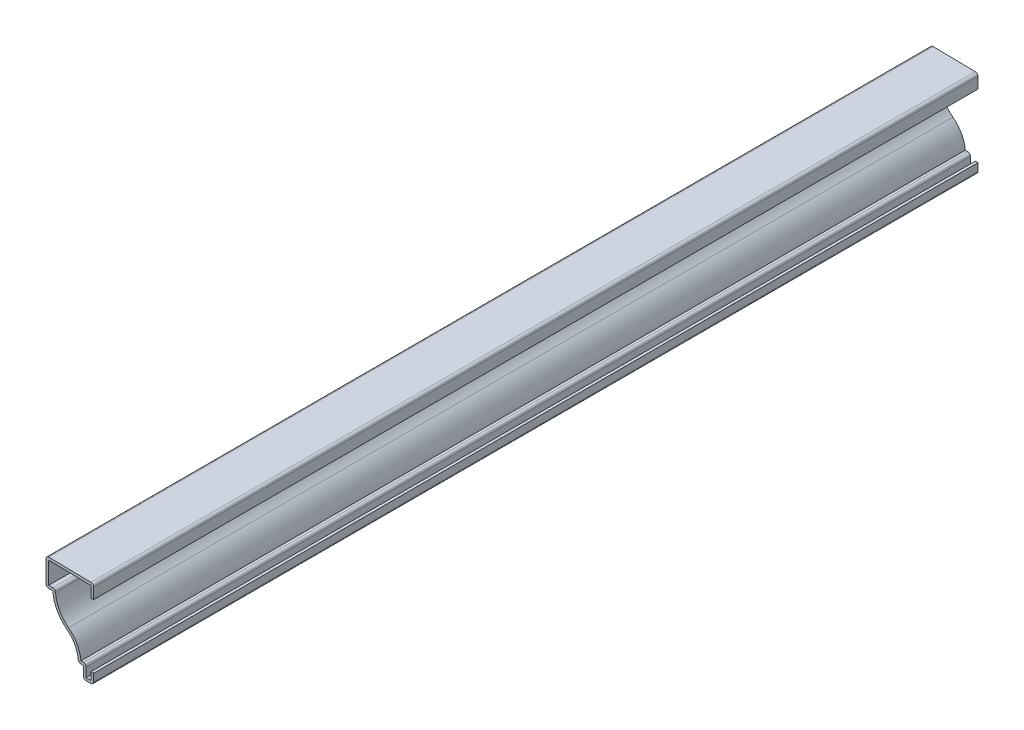
ISO-10303-21;
HEADER;
FILE_DESCRIPTION(('STEP AP214'),'2;1');
FILE_NAME('part.step','',(''),(''),'','','');
FILE_SCHEMA(('AUTOMOTIVE_DESIGN { 1 0 10303 214 1 1 1 1 }'));
ENDSEC;
DATA;
#1=APPLICATION_CONTEXT('core data for automotive mechanical design processes');
#2=APPLICATION_PROTOCOL_DEFINITION('international standard','automotive_design',2000,#1);
#3=PRODUCT_CONTEXT('',#1,'mechanical');
#4=PRODUCT('Part','Part','',(#3));
#5=PRODUCT_RELATED_PRODUCT_CATEGORY('part','',(#4));
#6=PRODUCT_DEFINITION_FORMATION('','',#4);
#7=PRODUCT_DEFINITION_CONTEXT('part definition',#1,'design');
#8=PRODUCT_DEFINITION('design','',#6,#7);
#9=PRODUCT_DEFINITION_SHAPE('','',#8);
#10=(LENGTH_UNIT() NAMED_UNIT(*) SI_UNIT(.MILLI.,.METRE.));
#11=(NAMED_UNIT(*) PLANE_ANGLE_UNIT() SI_UNIT($,.RADIAN.));
#12=(NAMED_UNIT(*) SI_UNIT($,.STERADIAN.) SOLID_ANGLE_UNIT());
#13=UNCERTAINTY_MEASURE_WITH_UNIT(LENGTH_MEASURE(1.E-05),#10,'distance_accuracy_value','');
#14=(GEOMETRIC_REPRESENTATION_CONTEXT(3) GLOBAL_UNCERTAINTY_ASSIGNED_CONTEXT((#13)) GLOBAL_UNIT_ASSIGNED_CONTEXT((#10,
#11,#12)) REPRESENTATION_CONTEXT('',''));
#15=CARTESIAN_POINT('',(0.,0.,0.));
#16=DIRECTION('',(0.,0.,1.));
#17=DIRECTION('',(1.,0.,0.));
#18=AXIS2_PLACEMENT_3D('',#15,#16,#17);
#19=CARTESIAN_POINT('',(-1.27,40.878125,-412.75));
#20=DIRECTION('',(-1.,0.,0.));
#21=DIRECTION('',(0.,-1.,0.));
#22=AXIS2_PLACEMENT_3D('',#19,#20,#21);
#23=PLANE('',#22);
#24=DIRECTION('',(0.,-1.,0.));
#25=VECTOR('',#24,1.);
#26=CARTESIAN_POINT('',(-1.27,40.878125,0.));
#27=LINE('',#26,#25);
#28=CARTESIAN_POINT('',(-1.27,39.6306011003233,0.));
#29=VERTEX_POINT('',#28);
#30=CARTESIAN_POINT('',(-1.27,34.528125,0.));
#31=VERTEX_POINT('',#30);
#32=EDGE_CURVE('E315',#29,#31,#27,.T.);
#33=ORIENTED_EDGE('',*,*,#32,.F.);
#34=DIRECTION('',(0.,0.,1.));
#35=VECTOR('',#34,1.);
#36=CARTESIAN_POINT('',(-1.27,39.6306011003233,-412.75));
#37=LINE('',#36,#35);
#38=CARTESIAN_POINT('',(-1.27,39.6306011003233,-412.75));
#39=VERTEX_POINT('',#38);
#40=EDGE_CURVE('E261',#39,#29,#37,.T.);
#41=ORIENTED_EDGE('',*,*,#40,.F.);
#42=DIRECTION('',(0.,-1.,0.));
#43=VECTOR('',#42,1.);
#44=CARTESIAN_POINT('',(-1.27,40.878125,-412.75));
#45=LINE('',#44,#43);
#46=CARTESIAN_POINT('',(-1.27,34.528125,-412.75));
#47=VERTEX_POINT('',#46);
#48=EDGE_CURVE('E242',#39,#47,#45,.T.);
#49=ORIENTED_EDGE('',*,*,#48,.T.);
#50=DIRECTION('',(0.,0.,1.));
#51=VECTOR('',#50,1.);
#52=CARTESIAN_POINT('',(-1.27,34.528125,-412.75));
#53=LINE('',#52,#51);
#54=EDGE_CURVE('E251',#47,#31,#53,.T.);
#55=ORIENTED_EDGE('',*,*,#54,.T.);
#56=EDGE_LOOP('',(#33,#41,#49,#55));
#57=FACE_BOUND('',#56,.T.);
#58=ADVANCED_FACE('F39',(#57),#23,.T.);
#59=CARTESIAN_POINT('',(-22.2476749564494,40.0052024388313,-412.75));
#60=DIRECTION('',(-0.0178542964168828,-0.999840599345445,0.));
#61=DIRECTION('',(0.999840599345445,-0.0178542964168828,0.));
#62=AXIS2_PLACEMENT_3D('',#59,#60,#61);
#63=PLANE('',#62);
#64=DIRECTION('',(0.999840599345445,-0.0178542964168828,0.));
#65=VECTOR('',#64,1.);
#66=CARTESIAN_POINT('',(-22.2476749564494,40.0052024388313,0.));
#67=LINE('',#66,#65);
#68=CARTESIAN_POINT('',(-20.955,39.9821189574661,0.));
#69=VERTEX_POINT('',#68);
#70=EDGE_CURVE('E262',#69,#29,#67,.T.);
#71=ORIENTED_EDGE('',*,*,#70,.F.);
#72=DIRECTION('',(0.,0.,1.));
#73=VECTOR('',#72,1.);
#74=CARTESIAN_POINT('',(-20.955,39.9821189574661,-412.75));
#75=LINE('',#74,#73);
#76=CARTESIAN_POINT('',(-20.955,39.9821189574661,-412.75));
#77=VERTEX_POINT('',#76);
#78=EDGE_CURVE('E368',#77,#69,#75,.T.);
#79=ORIENTED_EDGE('',*,*,#78,.F.);
#80=DIRECTION('',(0.999840599345445,-0.0178542964168828,0.));
#81=VECTOR('',#80,1.);
#82=CARTESIAN_POINT('',(-22.2476749564494,40.0052024388313,-412.75));
#83=LINE('',#82,#81);
#84=EDGE_CURVE('E259',#77,#39,#83,.T.);
#85=ORIENTED_EDGE('',*,*,#84,.T.);
#86=ORIENTED_EDGE('',*,*,#40,.T.);
#87=EDGE_LOOP('',(#71,#79,#85,#86));
#88=FACE_BOUND('',#87,.T.);
#89=ADVANCED_FACE('F490',(#88),#63,.T.);
#90=CARTESIAN_POINT('',(-20.955,28.575,-412.75));
#91=DIRECTION('',(1.,0.,0.));
#92=DIRECTION('',(0.,0.,-1.));
#93=AXIS2_PLACEMENT_3D('',#90,#91,#92);
#94=PLANE('',#93);
#95=DIRECTION('',(0.,1.,0.));
#96=VECTOR('',#95,1.);
#97=CARTESIAN_POINT('',(-20.955,28.575,0.));
#98=LINE('',#97,#96);
#99=CARTESIAN_POINT('',(-20.955,29.845,0.));
#100=VERTEX_POINT('',#99);
#101=EDGE_CURVE('E265',#100,#69,#98,.T.);
#102=ORIENTED_EDGE('',*,*,#101,.F.);
#103=DIRECTION('',(0.,0.,1.));
#104=VECTOR('',#103,1.);
#105=CARTESIAN_POINT('',(-20.955,29.845,-412.75));
#106=LINE('',#105,#104);
#107=CARTESIAN_POINT('',(-20.955,29.845,-412.75));
#108=VERTEX_POINT('',#107);
#109=EDGE_CURVE('E370',#108,#100,#106,.T.);
#110=ORIENTED_EDGE('',*,*,#109,.F.);
#111=DIRECTION('',(0.,1.,0.));
#112=VECTOR('',#111,1.);
#113=CARTESIAN_POINT('',(-20.955,28.575,-412.75));
#114=LINE('',#113,#112);
#115=EDGE_CURVE('E311',#108,#77,#114,.T.);
#116=ORIENTED_EDGE('',*,*,#115,.T.);
#117=ORIENTED_EDGE('',*,*,#78,.T.);
#118=EDGE_LOOP('',(#102,#110,#116,#117));
#119=FACE_BOUND('',#118,.T.);
#120=ADVANCED_FACE('F566',(#119),#94,.T.);
#121=CARTESIAN_POINT('',(-19.05,29.845,-412.75));
#122=DIRECTION('',(0.,1.,0.));
#123=DIRECTION('',(-1.,0.,0.));
#124=AXIS2_PLACEMENT_3D('',#121,#122,#123);
#125=PLANE('',#124);
#126=DIRECTION('',(-1.,0.,0.));
#127=VECTOR('',#126,1.);
#128=CARTESIAN_POINT('',(-19.05,29.845,0.));
#129=LINE('',#128,#127);
#130=CARTESIAN_POINT('',(-19.05,29.845,0.));
#131=VERTEX_POINT('',#130);
#132=EDGE_CURVE('E362',#131,#100,#129,.T.);
#133=ORIENTED_EDGE('',*,*,#132,.F.);
#134=DIRECTION('',(0.,0.,1.));
#135=VECTOR('',#134,1.);
#136=CARTESIAN_POINT('',(-19.05,29.845,-412.75));
#137=LINE('',#136,#135);
#138=CARTESIAN_POINT('',(-19.05,29.845,-412.75));
#139=VERTEX_POINT('',#138);
#140=EDGE_CURVE('E11',#131,#139,#137,.F.);
#141=ORIENTED_EDGE('',*,*,#140,.T.);
#142=DIRECTION('',(-1.,0.,0.));
#143=VECTOR('',#142,1.);
#144=CARTESIAN_POINT('',(-19.05,29.845,-412.75));
#145=LINE('',#144,#143);
#146=EDGE_CURVE('E309',#139,#108,#145,.T.);
#147=ORIENTED_EDGE('',*,*,#146,.T.);
#148=ORIENTED_EDGE('',*,*,#109,.T.);
#149=EDGE_LOOP('',(#133,#141,#147,#148));
#150=FACE_BOUND('',#149,.T.);
#151=ADVANCED_FACE('F484',(#150),#125,.T.);
#152=CARTESIAN_POINT('',(-2.33520395100903,29.6310701000696,-412.75));
#153=DIRECTION('',(0.,0.,1.));
#154=DIRECTION('',(1.,0.,0.));
#155=AXIS2_PLACEMENT_3D('',#152,#153,#154);
#156=CYLINDRICAL_SURFACE('',#155,15.478125);
#157=CARTESIAN_POINT('',(-2.33520395100903,29.6310701000696,-412.75));
#158=DIRECTION('',(0.,0.,1.));
#159=DIRECTION('',(1.,0.,0.));
#160=AXIS2_PLACEMENT_3D('',#157,#158,#159);
#161=CIRCLE('',#160,15.478125);
#162=CARTESIAN_POINT('',(-11.7025208264769,17.3093117811363,-412.75));
#163=VERTEX_POINT('',#162);
#164=CARTESIAN_POINT('',(-17.7825273138206,28.655081145029,-412.75));
#165=VERTEX_POINT('',#164);
#166=EDGE_CURVE('E306',#163,#165,#161,.F.);
#167=ORIENTED_EDGE('',*,*,#166,.T.);
#168=DIRECTION('',(0.,0.,1.));
#169=VECTOR('',#168,1.);
#170=CARTESIAN_POINT('',(-17.7825273138206,28.655081145029,-412.75));
#171=LINE('',#170,#169);
#172=CARTESIAN_POINT('',(-17.7825273138206,28.655081145029,0.));
#173=VERTEX_POINT('',#172);
#174=EDGE_CURVE('E47',#165,#173,#171,.T.);
#175=ORIENTED_EDGE('',*,*,#174,.T.);
#176=CARTESIAN_POINT('',(-2.33520395100903,29.6310701000696,0.));
#177=DIRECTION('',(0.,0.,1.));
#178=DIRECTION('',(1.,0.,0.));
#179=AXIS2_PLACEMENT_3D('',#176,#177,#178);
#180=CIRCLE('',#179,15.478125);
#181=CARTESIAN_POINT('',(-11.7025208264769,17.3093117811363,0.));
#182=VERTEX_POINT('',#181);
#183=EDGE_CURVE('E359',#182,#173,#180,.F.);
#184=ORIENTED_EDGE('',*,*,#183,.F.);
#185=DIRECTION('',(0.,0.,1.));
#186=VECTOR('',#185,1.);
#187=CARTESIAN_POINT('',(-11.7025208264769,17.3093117811363,-412.75));
#188=LINE('',#187,#186);
#189=EDGE_CURVE('E373',#163,#182,#188,.T.);
#190=ORIENTED_EDGE('',*,*,#189,.F.);
#191=EDGE_LOOP('',(#167,#175,#184,#190));
#192=FACE_BOUND('',#191,.T.);
#193=ADVANCED_FACE('F464',(#192),#156,.F.);
#194=CARTESIAN_POINT('',(-20.6375,5.55625,-412.75));
#195=DIRECTION('',(0.,0.,1.));
#196=DIRECTION('',(1.,0.,0.));
#197=AXIS2_PLACEMENT_3D('',#194,#195,#196);
#198=CYLINDRICAL_SURFACE('',#197,14.76375);
#199=CARTESIAN_POINT('',(-20.6375,5.55625,0.));
#200=DIRECTION('',(0.,0.,1.));
#201=DIRECTION('',(1.,0.,0.));
#202=AXIS2_PLACEMENT_3D('',#199,#200,#201);
#203=CIRCLE('',#202,14.76375);
#204=CARTESIAN_POINT('',(-5.9284750811789,6.82625,0.));
#205=VERTEX_POINT('',#204);
#206=EDGE_CURVE('E356',#205,#182,#203,.T.);
#207=ORIENTED_EDGE('',*,*,#206,.F.);
#208=DIRECTION('',(0.,0.,1.));
#209=VECTOR('',#208,1.);
#210=CARTESIAN_POINT('',(-5.9284750811789,6.82625,-412.75));
#211=LINE('',#210,#209);
#212=CARTESIAN_POINT('',(-5.9284750811789,6.82625,-412.75));
#213=VERTEX_POINT('',#212);
#214=EDGE_CURVE('E375',#213,#205,#211,.T.);
#215=ORIENTED_EDGE('',*,*,#214,.F.);
#216=CARTESIAN_POINT('',(-20.6375,5.55625,-412.75));
#217=DIRECTION('',(0.,0.,1.));
#218=DIRECTION('',(1.,0.,0.));
#219=AXIS2_PLACEMENT_3D('',#216,#217,#218);
#220=CIRCLE('',#219,14.76375);
#221=EDGE_CURVE('E303',#213,#163,#220,.T.);
#222=ORIENTED_EDGE('',*,*,#221,.T.);
#223=ORIENTED_EDGE('',*,*,#189,.T.);
#224=EDGE_LOOP('',(#207,#215,#222,#223));
#225=FACE_BOUND('',#224,.T.);
#226=ADVANCED_FACE('F476',(#225),#198,.T.);
#227=CARTESIAN_POINT('',(-4.7625,6.82625,-412.75));
#228=DIRECTION('',(0.,1.,0.));
#229=DIRECTION('',(-1.,0.,0.));
#230=AXIS2_PLACEMENT_3D('',#227,#228,#229);
#231=PLANE('',#230);
#232=DIRECTION('',(-1.,0.,0.));
#233=VECTOR('',#232,1.);
#234=CARTESIAN_POINT('',(-4.7625,6.82625,0.));
#235=LINE('',#234,#233);
#236=CARTESIAN_POINT('',(-4.7625,6.82625,0.));
#237=VERTEX_POINT('',#236);
#238=EDGE_CURVE('E354',#237,#205,#235,.T.);
#239=ORIENTED_EDGE('',*,*,#238,.F.);
#240=DIRECTION('',(0.,0.,1.));
#241=VECTOR('',#240,1.);
#242=CARTESIAN_POINT('',(-4.7625,6.82625,-412.75));
#243=LINE('',#242,#241);
#244=CARTESIAN_POINT('',(-4.7625,6.82625,-412.75));
#245=VERTEX_POINT('',#244);
#246=EDGE_CURVE('E448',#237,#245,#243,.F.);
#247=ORIENTED_EDGE('',*,*,#246,.T.);
#248=DIRECTION('',(-1.,0.,0.));
#249=VECTOR('',#248,1.);
#250=CARTESIAN_POINT('',(-4.7625,6.82625,-412.75));
#251=LINE('',#250,#249);
#252=EDGE_CURVE('E301',#245,#213,#251,.T.);
#253=ORIENTED_EDGE('',*,*,#252,.T.);
#254=ORIENTED_EDGE('',*,*,#214,.T.);
#255=EDGE_LOOP('',(#239,#247,#253,#254));
#256=FACE_BOUND('',#255,.T.);
#257=ADVANCED_FACE('F589',(#256),#231,.T.);
#258=CARTESIAN_POINT('',(-3.4925,0.,-412.75));
#259=DIRECTION('',(1.,0.,0.));
#260=DIRECTION('',(0.,0.,-1.));
#261=AXIS2_PLACEMENT_3D('',#258,#259,#260);
#262=PLANE('',#261);
#263=DIRECTION('',(0.,1.,0.));
#264=VECTOR('',#263,1.);
#265=CARTESIAN_POINT('',(-3.4925,0.,-412.75));
#266=LINE('',#265,#264);
#267=CARTESIAN_POINT('',(-3.4925,1.27,-412.75));
#268=VERTEX_POINT('',#267);
#269=CARTESIAN_POINT('',(-3.4925,5.55625,-412.75));
#270=VERTEX_POINT('',#269);
#271=EDGE_CURVE('E298',#268,#270,#266,.T.);
#272=ORIENTED_EDGE('',*,*,#271,.T.);
#273=DIRECTION('',(0.,0.,1.));
#274=VECTOR('',#273,1.);
#275=CARTESIAN_POINT('',(-3.4925,5.55625,-412.75));
#276=LINE('',#275,#274);
#277=CARTESIAN_POINT('',(-3.4925,5.55625,0.));
#278=VERTEX_POINT('',#277);
#279=EDGE_CURVE('E445',#270,#278,#276,.T.);
#280=ORIENTED_EDGE('',*,*,#279,.T.);
#281=DIRECTION('',(0.,1.,0.));
#282=VECTOR('',#281,1.);
#283=CARTESIAN_POINT('',(-3.4925,0.,0.));
#284=LINE('',#283,#282);
#285=CARTESIAN_POINT('',(-3.4925,1.27,0.));
#286=VERTEX_POINT('',#285);
#287=EDGE_CURVE('E351',#286,#278,#284,.T.);
#288=ORIENTED_EDGE('',*,*,#287,.F.);
#289=DIRECTION('',(0.,0.,1.));
#290=VECTOR('',#289,1.);
#291=CARTESIAN_POINT('',(-3.4925,1.27,-412.75));
#292=LINE('',#291,#290);
#293=EDGE_CURVE('E378',#268,#286,#292,.T.);
#294=ORIENTED_EDGE('',*,*,#293,.F.);
#295=EDGE_LOOP('',(#272,#280,#288,#294));
#296=FACE_BOUND('',#295,.T.);
#297=ADVANCED_FACE('F592',(#296),#262,.T.);
#298=CARTESIAN_POINT('',(0.,1.27,-412.75));
#299=DIRECTION('',(0.,1.,0.));
#300=DIRECTION('',(-1.,0.,0.));
#301=AXIS2_PLACEMENT_3D('',#298,#299,#300);
#302=PLANE('',#301);
#303=DIRECTION('',(-1.,0.,0.));
#304=VECTOR('',#303,1.);
#305=CARTESIAN_POINT('',(0.,1.27,0.));
#306=LINE('',#305,#304);
#307=CARTESIAN_POINT('',(-1.27,1.27,0.));
#308=VERTEX_POINT('',#307);
#309=EDGE_CURVE('E348',#308,#286,#306,.T.);
#310=ORIENTED_EDGE('',*,*,#309,.F.);
#311=DIRECTION('',(0.,0.,1.));
#312=VECTOR('',#311,1.);
#313=CARTESIAN_POINT('',(-1.27,1.27,-412.75));
#314=LINE('',#313,#312);
#315=CARTESIAN_POINT('',(-1.27,1.27,-412.75));
#316=VERTEX_POINT('',#315);
#317=EDGE_CURVE('E380',#316,#308,#314,.T.);
#318=ORIENTED_EDGE('',*,*,#317,.F.);
#319=DIRECTION('',(-1.,0.,0.));
#320=VECTOR('',#319,1.);
#321=CARTESIAN_POINT('',(0.,1.27,-412.75));
#322=LINE('',#321,#320);
#323=EDGE_CURVE('E295',#316,#268,#322,.T.);
#324=ORIENTED_EDGE('',*,*,#323,.T.);
#325=ORIENTED_EDGE('',*,*,#293,.T.);
#326=EDGE_LOOP('',(#310,#318,#324,#325));
#327=FACE_BOUND('',#326,.T.);
#328=ADVANCED_FACE('F596',(#327),#302,.T.);
#329=CARTESIAN_POINT('',(-1.27,4.7625,-412.75));
#330=DIRECTION('',(-1.,0.,0.));
#331=DIRECTION('',(0.,-1.,0.));
#332=AXIS2_PLACEMENT_3D('',#329,#330,#331);
#333=PLANE('',#332);
#334=DIRECTION('',(0.,-1.,0.));
#335=VECTOR('',#334,1.);
#336=CARTESIAN_POINT('',(-1.27,4.7625,0.));
#337=LINE('',#336,#335);
#338=CARTESIAN_POINT('',(-1.27,4.7625,0.));
#339=VERTEX_POINT('',#338);
#340=EDGE_CURVE('E345',#339,#308,#337,.T.);
#341=ORIENTED_EDGE('',*,*,#340,.F.);
#342=DIRECTION('',(0.,0.,1.));
#343=VECTOR('',#342,1.);
#344=CARTESIAN_POINT('',(-1.27,4.7625,-412.75));
#345=LINE('',#344,#343);
#346=CARTESIAN_POINT('',(-1.27,4.7625,-412.75));
#347=VERTEX_POINT('',#346);
#348=EDGE_CURVE('E382',#347,#339,#345,.T.);
#349=ORIENTED_EDGE('',*,*,#348,.F.);
#350=DIRECTION('',(0.,-1.,0.));
#351=VECTOR('',#350,1.);
#352=CARTESIAN_POINT('',(-1.27,4.7625,-412.75));
#353=LINE('',#352,#351);
#354=EDGE_CURVE('E292',#347,#316,#353,.T.);
#355=ORIENTED_EDGE('',*,*,#354,.T.);
#356=ORIENTED_EDGE('',*,*,#317,.T.);
#357=EDGE_LOOP('',(#341,#349,#355,#356));
#358=FACE_BOUND('',#357,.T.);
#359=ADVANCED_FACE('F600',(#358),#333,.T.);
#360=CARTESIAN_POINT('',(-1.27,4.7625,-412.75));
#361=DIRECTION('',(0.,-1.,0.));
#362=DIRECTION('',(1.,0.,0.));
#363=AXIS2_PLACEMENT_3D('',#360,#361,#362);
#364=PLANE('',#363);
#365=DIRECTION('',(1.,0.,0.));
#366=VECTOR('',#365,1.);
#367=CARTESIAN_POINT('',(-1.27,4.7625,0.));
#368=LINE('',#367,#366);
#369=CARTESIAN_POINT('',(0.,4.7625,0.));
#370=VERTEX_POINT('',#369);
#371=EDGE_CURVE('E343',#339,#370,#368,.T.);
#372=ORIENTED_EDGE('',*,*,#371,.T.);
#373=DIRECTION('',(0.,0.,1.));
#374=VECTOR('',#373,1.);
#375=CARTESIAN_POINT('',(0.,4.7625,-412.75));
#376=LINE('',#375,#374);
#377=CARTESIAN_POINT('',(0.,4.7625,-412.75));
#378=VERTEX_POINT('',#377);
#379=EDGE_CURVE('E384',#378,#370,#376,.T.);
#380=ORIENTED_EDGE('',*,*,#379,.F.);
#381=DIRECTION('',(1.,0.,0.));
#382=VECTOR('',#381,1.);
#383=CARTESIAN_POINT('',(-1.27,4.7625,-412.75));
#384=LINE('',#383,#382);
#385=EDGE_CURVE('E290',#347,#378,#384,.T.);
#386=ORIENTED_EDGE('',*,*,#385,.F.);
#387=ORIENTED_EDGE('',*,*,#348,.T.);
#388=EDGE_LOOP('',(#372,#380,#386,#387));
#389=FACE_BOUND('',#388,.T.);
#390=ADVANCED_FACE('F604',(#389),#364,.F.);
#391=CARTESIAN_POINT('',(0.,4.7625,-412.75));
#392=DIRECTION('',(-1.,0.,0.));
#393=DIRECTION('',(0.,-1.,0.));
#394=AXIS2_PLACEMENT_3D('',#391,#392,#393);
#395=PLANE('',#394);
#396=DIRECTION('',(0.,-1.,0.));
#397=VECTOR('',#396,1.);
#398=CARTESIAN_POINT('',(0.,4.7625,0.));
#399=LINE('',#398,#397);
#400=CARTESIAN_POINT('',(0.,1.27,0.));
#401=VERTEX_POINT('',#400);
#402=EDGE_CURVE('E340',#370,#401,#399,.T.);
#403=ORIENTED_EDGE('',*,*,#402,.T.);
#404=DIRECTION('',(0.,0.,1.));
#405=VECTOR('',#404,1.);
#406=CARTESIAN_POINT('',(0.,1.27,-412.75));
#407=LINE('',#406,#405);
#408=CARTESIAN_POINT('',(0.,1.27,-412.75));
#409=VERTEX_POINT('',#408);
#410=EDGE_CURVE('E440',#401,#409,#407,.F.);
#411=ORIENTED_EDGE('',*,*,#410,.T.);
#412=DIRECTION('',(0.,-1.,0.));
#413=VECTOR('',#412,1.);
#414=CARTESIAN_POINT('',(0.,4.7625,-412.75));
#415=LINE('',#414,#413);
#416=EDGE_CURVE('E287',#378,#409,#415,.T.);
#417=ORIENTED_EDGE('',*,*,#416,.F.);
#418=ORIENTED_EDGE('',*,*,#379,.T.);
#419=EDGE_LOOP('',(#403,#411,#417,#418));
#420=FACE_BOUND('',#419,.T.);
#421=ADVANCED_FACE('F608',(#420),#395,.F.);
#422=CARTESIAN_POINT('',(0.,0.,-412.75));
#423=DIRECTION('',(0.,1.,0.));
#424=DIRECTION('',(-1.,0.,0.));
#425=AXIS2_PLACEMENT_3D('',#422,#423,#424);
#426=PLANE('',#425);
#427=DIRECTION('',(-1.,0.,0.));
#428=VECTOR('',#427,1.);
#429=CARTESIAN_POINT('',(0.,0.,-412.75));
#430=LINE('',#429,#428);
#431=CARTESIAN_POINT('',(-1.27,0.,-412.75));
#432=VERTEX_POINT('',#431);
#433=CARTESIAN_POINT('',(-3.4925,0.,-412.75));
#434=VERTEX_POINT('',#433);
#435=EDGE_CURVE('E284',#432,#434,#430,.T.);
#436=ORIENTED_EDGE('',*,*,#435,.F.);
#437=DIRECTION('',(0.,0.,1.));
#438=VECTOR('',#437,1.);
#439=CARTESIAN_POINT('',(-1.27,0.,-412.75));
#440=LINE('',#439,#438);
#441=CARTESIAN_POINT('',(-1.27,0.,0.));
#442=VERTEX_POINT('',#441);
#443=EDGE_CURVE('E437',#432,#442,#440,.T.);
#444=ORIENTED_EDGE('',*,*,#443,.T.);
#445=DIRECTION('',(-1.,0.,0.));
#446=VECTOR('',#445,1.);
#447=CARTESIAN_POINT('',(0.,0.,0.));
#448=LINE('',#447,#446);
#449=CARTESIAN_POINT('',(-3.4925,0.,0.));
#450=VERTEX_POINT('',#449);
#451=EDGE_CURVE('E337',#442,#450,#448,.T.);
#452=ORIENTED_EDGE('',*,*,#451,.T.);
#453=DIRECTION('',(0.,0.,1.));
#454=VECTOR('',#453,1.);
#455=CARTESIAN_POINT('',(-3.4925,0.,-412.75));
#456=LINE('',#455,#454);
#457=EDGE_CURVE('E435',#450,#434,#456,.F.);
#458=ORIENTED_EDGE('',*,*,#457,.T.);
#459=EDGE_LOOP('',(#436,#444,#452,#458));
#460=FACE_BOUND('',#459,.T.);
#461=ADVANCED_FACE('F546',(#460),#426,.F.);
#462=CARTESIAN_POINT('',(-4.7625,0.,-412.75));
#463=DIRECTION('',(1.,0.,0.));
#464=DIRECTION('',(0.,0.,-1.));
#465=AXIS2_PLACEMENT_3D('',#462,#463,#464);
#466=PLANE('',#465);
#467=DIRECTION('',(0.,1.,0.));
#468=VECTOR('',#467,1.);
#469=CARTESIAN_POINT('',(-4.7625,0.,-412.75));
#470=LINE('',#469,#468);
#471=CARTESIAN_POINT('',(-4.7625,1.27,-412.75));
#472=VERTEX_POINT('',#471);
#473=CARTESIAN_POINT('',(-4.7625,5.55625,-412.75));
#474=VERTEX_POINT('',#473);
#475=EDGE_CURVE('E282',#472,#474,#470,.T.);
#476=ORIENTED_EDGE('',*,*,#475,.F.);
#477=DIRECTION('',(0.,0.,1.));
#478=VECTOR('',#477,1.);
#479=CARTESIAN_POINT('',(-4.7625,1.27,-412.75));
#480=LINE('',#479,#478);
#481=CARTESIAN_POINT('',(-4.7625,1.27,0.));
#482=VERTEX_POINT('',#481);
#483=EDGE_CURVE('E442',#472,#482,#480,.T.);
#484=ORIENTED_EDGE('',*,*,#483,.T.);
#485=DIRECTION('',(0.,1.,0.));
#486=VECTOR('',#485,1.);
#487=CARTESIAN_POINT('',(-4.7625,0.,0.));
#488=LINE('',#487,#486);
#489=CARTESIAN_POINT('',(-4.7625,5.55625,0.));
#490=VERTEX_POINT('',#489);
#491=EDGE_CURVE('E335',#482,#490,#488,.T.);
#492=ORIENTED_EDGE('',*,*,#491,.T.);
#493=DIRECTION('',(0.,0.,1.));
#494=VECTOR('',#493,1.);
#495=CARTESIAN_POINT('',(-4.7625,5.55625,-412.75));
#496=LINE('',#495,#494);
#497=EDGE_CURVE('E387',#474,#490,#496,.T.);
#498=ORIENTED_EDGE('',*,*,#497,.F.);
#499=EDGE_LOOP('',(#476,#484,#492,#498));
#500=FACE_BOUND('',#499,.T.);
#501=ADVANCED_FACE('F539',(#500),#466,.F.);
#502=CARTESIAN_POINT('',(-4.7625,5.55625,-412.75));
#503=DIRECTION('',(0.,1.,0.));
#504=DIRECTION('',(-1.,0.,0.));
#505=AXIS2_PLACEMENT_3D('',#502,#503,#504);
#506=PLANE('',#505);
#507=DIRECTION('',(-1.,0.,0.));
#508=VECTOR('',#507,1.);
#509=CARTESIAN_POINT('',(-4.7625,5.55625,0.));
#510=LINE('',#509,#508);
#511=CARTESIAN_POINT('',(-5.9284750811789,5.55625,0.));
#512=VERTEX_POINT('',#511);
#513=EDGE_CURVE('E332',#490,#512,#510,.T.);
#514=ORIENTED_EDGE('',*,*,#513,.T.);
#515=DIRECTION('',(0.,0.,1.));
#516=VECTOR('',#515,1.);
#517=CARTESIAN_POINT('',(-5.9284750811789,5.55625,-412.75));
#518=LINE('',#517,#516);
#519=CARTESIAN_POINT('',(-5.9284750811789,5.55625,-412.75));
#520=VERTEX_POINT('',#519);
#521=EDGE_CURVE('E453',#512,#520,#518,.F.);
#522=ORIENTED_EDGE('',*,*,#521,.T.);
#523=DIRECTION('',(-1.,0.,0.));
#524=VECTOR('',#523,1.);
#525=CARTESIAN_POINT('',(-4.7625,5.55625,-412.75));
#526=LINE('',#525,#524);
#527=EDGE_CURVE('E279',#474,#520,#526,.T.);
#528=ORIENTED_EDGE('',*,*,#527,.F.);
#529=ORIENTED_EDGE('',*,*,#497,.T.);
#530=EDGE_LOOP('',(#514,#522,#528,#529));
#531=FACE_BOUND('',#530,.T.);
#532=ADVANCED_FACE('F533',(#531),#506,.F.);
#533=CARTESIAN_POINT('',(-20.6375,5.55625,-412.75));
#534=DIRECTION('',(0.,0.,1.));
#535=DIRECTION('',(1.,0.,0.));
#536=AXIS2_PLACEMENT_3D('',#533,#534,#535);
#537=CYLINDRICAL_SURFACE('',#536,13.49375);
#538=CARTESIAN_POINT('',(-20.6375,5.55625,-412.75));
#539=DIRECTION('',(0.,0.,1.));
#540=DIRECTION('',(1.,0.,0.));
#541=AXIS2_PLACEMENT_3D('',#538,#539,#540);
#542=CIRCLE('',#541,13.49375);
#543=CARTESIAN_POINT('',(-7.19376754731405,6.71700268817204,-412.75));
#544=VERTEX_POINT('',#543);
#545=CARTESIAN_POINT('',(-12.4711211854896,16.2982957139418,-412.75));
#546=VERTEX_POINT('',#545);
#547=EDGE_CURVE('E277',#544,#546,#542,.T.);
#548=ORIENTED_EDGE('',*,*,#547,.F.);
#549=DIRECTION('',(0.,0.,1.));
#550=VECTOR('',#549,1.);
#551=CARTESIAN_POINT('',(-7.19376754731405,6.71700268817204,-412.75));
#552=LINE('',#551,#550);
#553=CARTESIAN_POINT('',(-7.19376754731405,6.71700268817204,0.));
#554=VERTEX_POINT('',#553);
#555=EDGE_CURVE('E450',#544,#554,#552,.T.);
#556=ORIENTED_EDGE('',*,*,#555,.T.);
#557=CARTESIAN_POINT('',(-20.6375,5.55625,0.));
#558=DIRECTION('',(0.,0.,1.));
#559=DIRECTION('',(1.,0.,0.));
#560=AXIS2_PLACEMENT_3D('',#557,#558,#559);
#561=CIRCLE('',#560,13.49375);
#562=CARTESIAN_POINT('',(-12.4711211854896,16.2982957139418,0.));
#563=VERTEX_POINT('',#562);
#564=EDGE_CURVE('E330',#554,#563,#561,.T.);
#565=ORIENTED_EDGE('',*,*,#564,.T.);
#566=DIRECTION('',(0.,0.,1.));
#567=VECTOR('',#566,1.);
#568=CARTESIAN_POINT('',(-12.4711211854896,16.2982957139418,-412.75));
#569=LINE('',#568,#567);
#570=EDGE_CURVE('E390',#546,#563,#569,.T.);
#571=ORIENTED_EDGE('',*,*,#570,.F.);
#572=EDGE_LOOP('',(#548,#556,#565,#571));
#573=FACE_BOUND('',#572,.T.);
#574=ADVANCED_FACE('F525',(#573),#537,.F.);
#575=CARTESIAN_POINT('',(-2.33520395100903,29.6310701000696,-412.75));
#576=DIRECTION('',(0.,0.,1.));
#577=DIRECTION('',(1.,0.,0.));
#578=AXIS2_PLACEMENT_3D('',#575,#576,#577);
#579=CYLINDRICAL_SURFACE('',#578,16.748125);
#580=CARTESIAN_POINT('',(-2.33520395100903,29.6310701000696,0.));
#581=DIRECTION('',(0.,0.,-1.));
#582=DIRECTION('',(-1.,0.,0.));
#583=AXIS2_PLACEMENT_3D('',#580,#581,#582);
#584=CIRCLE('',#583,16.748125);
#585=CARTESIAN_POINT('',(-19.05,28.575,0.));
#586=VERTEX_POINT('',#585);
#587=EDGE_CURVE('E328',#563,#586,#584,.T.);
#588=ORIENTED_EDGE('',*,*,#587,.T.);
#589=DIRECTION('',(0.,0.,1.));
#590=VECTOR('',#589,1.);
#591=CARTESIAN_POINT('',(-19.05,28.575,-412.75));
#592=LINE('',#591,#590);
#593=CARTESIAN_POINT('',(-19.05,28.575,-412.75));
#594=VERTEX_POINT('',#593);
#595=EDGE_CURVE('E393',#594,#586,#592,.T.);
#596=ORIENTED_EDGE('',*,*,#595,.F.);
#597=CARTESIAN_POINT('',(-2.33520395100903,29.6310701000696,-412.75));
#598=DIRECTION('',(0.,0.,-1.));
#599=DIRECTION('',(-1.,0.,0.));
#600=AXIS2_PLACEMENT_3D('',#597,#598,#599);
#601=CIRCLE('',#600,16.748125);
#602=EDGE_CURVE('E275',#546,#594,#601,.T.);
#603=ORIENTED_EDGE('',*,*,#602,.F.);
#604=ORIENTED_EDGE('',*,*,#570,.T.);
#605=EDGE_LOOP('',(#588,#596,#603,#604));
#606=FACE_BOUND('',#605,.T.);
#607=ADVANCED_FACE('F519',(#606),#579,.T.);
#608=CARTESIAN_POINT('',(-19.05,28.575,-412.75));
#609=DIRECTION('',(0.,1.,0.));
#610=DIRECTION('',(-1.,0.,0.));
#611=AXIS2_PLACEMENT_3D('',#608,#609,#610);
#612=PLANE('',#611);
#613=DIRECTION('',(-1.,0.,0.));
#614=VECTOR('',#613,1.);
#615=CARTESIAN_POINT('',(-19.05,28.575,0.));
#616=LINE('',#615,#614);
#617=CARTESIAN_POINT('',(-20.955,28.575,0.));
#618=VERTEX_POINT('',#617);
#619=EDGE_CURVE('E325',#586,#618,#616,.T.);
#620=ORIENTED_EDGE('',*,*,#619,.T.);
#621=DIRECTION('',(0.,0.,1.));
#622=VECTOR('',#621,1.);
#623=CARTESIAN_POINT('',(-20.955,28.575,-412.75));
#624=LINE('',#623,#622);
#625=CARTESIAN_POINT('',(-20.955,28.575,-412.75));
#626=VERTEX_POINT('',#625);
#627=EDGE_CURVE('E459',#618,#626,#624,.F.);
#628=ORIENTED_EDGE('',*,*,#627,.T.);
#629=DIRECTION('',(-1.,0.,0.));
#630=VECTOR('',#629,1.);
#631=CARTESIAN_POINT('',(-19.05,28.575,-412.75));
#632=LINE('',#631,#630);
#633=EDGE_CURVE('E273',#594,#626,#632,.T.);
#634=ORIENTED_EDGE('',*,*,#633,.F.);
#635=ORIENTED_EDGE('',*,*,#595,.T.);
#636=EDGE_LOOP('',(#620,#628,#634,#635));
#637=FACE_BOUND('',#636,.T.);
#638=ADVANCED_FACE('F514',(#637),#612,.F.);
#639=CARTESIAN_POINT('',(-22.225,28.575,-412.75));
#640=DIRECTION('',(1.,0.,0.));
#641=DIRECTION('',(0.,0.,-1.));
#642=AXIS2_PLACEMENT_3D('',#639,#640,#641);
#643=PLANE('',#642);
#644=DIRECTION('',(0.,1.,0.));
#645=VECTOR('',#644,1.);
#646=CARTESIAN_POINT('',(-22.225,28.575,-412.75));
#647=LINE('',#646,#645);
#648=CARTESIAN_POINT('',(-22.225,29.845,-412.75));
#649=VERTEX_POINT('',#648);
#650=CARTESIAN_POINT('',(-22.225,39.9821189574661,-412.75));
#651=VERTEX_POINT('',#650);
#652=EDGE_CURVE('E271',#649,#651,#647,.T.);
#653=ORIENTED_EDGE('',*,*,#652,.F.);
#654=DIRECTION('',(0.,0.,1.));
#655=VECTOR('',#654,1.);
#656=CARTESIAN_POINT('',(-22.225,29.845,-412.75));
#657=LINE('',#656,#655);
#658=CARTESIAN_POINT('',(-22.225,29.845,0.));
#659=VERTEX_POINT('',#658);
#660=EDGE_CURVE('E456',#649,#659,#657,.T.);
#661=ORIENTED_EDGE('',*,*,#660,.T.);
#662=DIRECTION('',(0.,1.,0.));
#663=VECTOR('',#662,1.);
#664=CARTESIAN_POINT('',(-22.225,28.575,0.));
#665=LINE('',#664,#663);
#666=CARTESIAN_POINT('',(-22.225,39.9821189574661,0.));
#667=VERTEX_POINT('',#666);
#668=EDGE_CURVE('E323',#659,#667,#665,.T.);
#669=ORIENTED_EDGE('',*,*,#668,.T.);
#670=DIRECTION('',(0.,0.,1.));
#671=VECTOR('',#670,1.);
#672=CARTESIAN_POINT('',(-22.225,39.9821189574661,-412.75));
#673=LINE('',#672,#671);
#674=EDGE_CURVE('E54',#667,#651,#673,.F.);
#675=ORIENTED_EDGE('',*,*,#674,.T.);
#676=EDGE_LOOP('',(#653,#661,#669,#675));
#677=FACE_BOUND('',#676,.T.);
#678=ADVANCED_FACE('F506',(#677),#643,.F.);
#679=CARTESIAN_POINT('',(-22.225,41.275,-412.75));
#680=DIRECTION('',(-0.0178542964168828,-0.999840599345445,0.));
#681=DIRECTION('',(0.999840599345445,-0.0178542964168828,0.));
#682=AXIS2_PLACEMENT_3D('',#679,#680,#681);
#683=PLANE('',#682);
#684=DIRECTION('',(0.999840599345445,-0.0178542964168828,0.));
#685=VECTOR('',#684,1.);
#686=CARTESIAN_POINT('',(-22.225,41.275,0.));
#687=LINE('',#686,#685);
#688=CARTESIAN_POINT('',(-20.9323250435506,41.2519165186348,0.));
#689=VERTEX_POINT('',#688);
#690=CARTESIAN_POINT('',(-1.24732504355056,40.900398661492,0.));
#691=VERTEX_POINT('',#690);
#692=EDGE_CURVE('E320',#689,#691,#687,.T.);
#693=ORIENTED_EDGE('',*,*,#692,.T.);
#694=DIRECTION('',(0.,0.,1.));
#695=VECTOR('',#694,1.);
#696=CARTESIAN_POINT('',(-1.24732504355056,40.900398661492,-412.75));
#697=LINE('',#696,#695);
#698=CARTESIAN_POINT('',(-1.24732504355056,40.900398661492,-412.75));
#699=VERTEX_POINT('',#698);
#700=EDGE_CURVE('E418',#691,#699,#697,.F.);
#701=ORIENTED_EDGE('',*,*,#700,.T.);
#702=DIRECTION('',(0.999840599345445,-0.0178542964168828,0.));
#703=VECTOR('',#702,1.);
#704=CARTESIAN_POINT('',(-22.225,41.275,-412.75));
#705=LINE('',#704,#703);
#706=CARTESIAN_POINT('',(-20.9323250435506,41.2519165186348,-412.75));
#707=VERTEX_POINT('',#706);
#708=EDGE_CURVE('E269',#707,#699,#705,.T.);
#709=ORIENTED_EDGE('',*,*,#708,.F.);
#710=DIRECTION('',(0.,0.,1.));
#711=VECTOR('',#710,1.);
#712=CARTESIAN_POINT('',(-20.9323250435506,41.2519165186348,-412.75));
#713=LINE('',#712,#711);
#714=EDGE_CURVE('E415',#707,#689,#713,.T.);
#715=ORIENTED_EDGE('',*,*,#714,.T.);
#716=EDGE_LOOP('',(#693,#701,#709,#715));
#717=FACE_BOUND('',#716,.T.);
#718=ADVANCED_FACE('F501',(#717),#683,.F.);
#719=CARTESIAN_POINT('',(0.,40.878125,-412.75));
#720=DIRECTION('',(-1.,0.,0.));
#721=DIRECTION('',(0.,-1.,0.));
#722=AXIS2_PLACEMENT_3D('',#719,#720,#721);
#723=PLANE('',#722);
#724=DIRECTION('',(0.,-1.,0.));
#725=VECTOR('',#724,1.);
#726=CARTESIAN_POINT('',(0.,40.878125,-412.75));
#727=LINE('',#726,#725);
#728=CARTESIAN_POINT('',(0.,39.6306011003233,-412.75));
#729=VERTEX_POINT('',#728);
#730=CARTESIAN_POINT('',(0.,34.528125,-412.75));
#731=VERTEX_POINT('',#730);
#732=EDGE_CURVE('E245',#729,#731,#727,.T.);
#733=ORIENTED_EDGE('',*,*,#732,.F.);
#734=DIRECTION('',(0.,0.,1.));
#735=VECTOR('',#734,1.);
#736=CARTESIAN_POINT('',(0.,39.6306011003233,-412.75));
#737=LINE('',#736,#735);
#738=CARTESIAN_POINT('',(0.,39.6306011003233,0.));
#739=VERTEX_POINT('',#738);
#740=EDGE_CURVE('E367',#729,#739,#737,.T.);
#741=ORIENTED_EDGE('',*,*,#740,.T.);
#742=DIRECTION('',(0.,-1.,0.));
#743=VECTOR('',#742,1.);
#744=CARTESIAN_POINT('',(0.,40.878125,0.));
#745=LINE('',#744,#743);
#746=CARTESIAN_POINT('',(0.,34.528125,0.));
#747=VERTEX_POINT('',#746);
#748=EDGE_CURVE('E318',#739,#747,#745,.T.);
#749=ORIENTED_EDGE('',*,*,#748,.T.);
#750=DIRECTION('',(0.,0.,1.));
#751=VECTOR('',#750,1.);
#752=CARTESIAN_POINT('',(0.,34.528125,-412.75));
#753=LINE('',#752,#751);
#754=EDGE_CURVE('E258',#731,#747,#753,.T.);
#755=ORIENTED_EDGE('',*,*,#754,.F.);
#756=EDGE_LOOP('',(#733,#741,#749,#755));
#757=FACE_BOUND('',#756,.T.);
#758=ADVANCED_FACE('F493',(#757),#723,.F.);
#759=CARTESIAN_POINT('',(0.,34.528125,-412.75));
#760=DIRECTION('',(0.,1.,0.));
#761=DIRECTION('',(0.,0.,1.));
#762=AXIS2_PLACEMENT_3D('',#759,#760,#761);
#763=PLANE('',#762);
#764=DIRECTION('',(-1.,0.,0.));
#765=VECTOR('',#764,1.);
#766=CARTESIAN_POINT('',(0.,34.528125,0.));
#767=LINE('',#766,#765);
#768=EDGE_CURVE('E254',#747,#31,#767,.T.);
#769=ORIENTED_EDGE('',*,*,#768,.T.);
#770=ORIENTED_EDGE('',*,*,#54,.F.);
#771=DIRECTION('',(-1.,0.,0.));
#772=VECTOR('',#771,1.);
#773=CARTESIAN_POINT('',(0.,34.528125,-412.75));
#774=LINE('',#773,#772);
#775=EDGE_CURVE('E236',#731,#47,#774,.T.);
#776=ORIENTED_EDGE('',*,*,#775,.F.);
#777=ORIENTED_EDGE('',*,*,#754,.T.);
#778=EDGE_LOOP('',(#769,#770,#776,#777));
#779=FACE_BOUND('',#778,.T.);
#780=ADVANCED_FACE('F252',(#779),#763,.F.);
#781=CARTESIAN_POINT('',(-2.33520395100903,29.6310701000696,-412.75));
#782=DIRECTION('',(0.,0.,-1.));
#783=DIRECTION('',(-1.,0.,0.));
#784=AXIS2_PLACEMENT_3D('',#781,#782,#783);
#785=PLANE('',#784);
#786=ORIENTED_EDGE('',*,*,#708,.T.);
#787=CARTESIAN_POINT('',(-1.27,39.6306011003233,-412.75));
#788=DIRECTION('',(0.,0.,-1.));
#789=DIRECTION('',(-1.,0.,0.));
#790=AXIS2_PLACEMENT_3D('',#787,#788,#789);
#791=CIRCLE('',#790,1.27);
#792=EDGE_CURVE('E433',#699,#729,#791,.T.);
#793=ORIENTED_EDGE('',*,*,#792,.T.);
#794=ORIENTED_EDGE('',*,*,#732,.T.);
#795=ORIENTED_EDGE('',*,*,#775,.T.);
#796=ORIENTED_EDGE('',*,*,#48,.F.);
#797=ORIENTED_EDGE('',*,*,#84,.F.);
#798=ORIENTED_EDGE('',*,*,#115,.F.);
#799=ORIENTED_EDGE('',*,*,#146,.F.);
#800=CARTESIAN_POINT('',(-19.05,28.575,-412.75));
#801=DIRECTION('',(0.,0.,-1.));
#802=DIRECTION('',(-1.,0.,0.));
#803=AXIS2_PLACEMENT_3D('',#800,#801,#802);
#804=CIRCLE('',#803,1.27);
#805=EDGE_CURVE('E422',#139,#165,#804,.T.);
#806=ORIENTED_EDGE('',*,*,#805,.T.);
#807=ORIENTED_EDGE('',*,*,#166,.F.);
#808=ORIENTED_EDGE('',*,*,#221,.F.);
#809=ORIENTED_EDGE('',*,*,#252,.F.);
#810=CARTESIAN_POINT('',(-4.7625,5.55625,-412.75));
#811=DIRECTION('',(0.,0.,-1.));
#812=DIRECTION('',(-1.,0.,0.));
#813=AXIS2_PLACEMENT_3D('',#810,#811,#812);
#814=CIRCLE('',#813,1.27);
#815=EDGE_CURVE('E427',#245,#270,#814,.T.);
#816=ORIENTED_EDGE('',*,*,#815,.T.);
#817=ORIENTED_EDGE('',*,*,#271,.F.);
#818=ORIENTED_EDGE('',*,*,#323,.F.);
#819=ORIENTED_EDGE('',*,*,#354,.F.);
#820=ORIENTED_EDGE('',*,*,#385,.T.);
#821=ORIENTED_EDGE('',*,*,#416,.T.);
#822=CARTESIAN_POINT('',(-1.27,1.27,-412.75));
#823=DIRECTION('',(0.,0.,-1.));
#824=DIRECTION('',(-1.,0.,0.));
#825=AXIS2_PLACEMENT_3D('',#822,#823,#824);
#826=CIRCLE('',#825,1.27);
#827=EDGE_CURVE('E431',#409,#432,#826,.T.);
#828=ORIENTED_EDGE('',*,*,#827,.T.);
#829=ORIENTED_EDGE('',*,*,#435,.T.);
#830=CARTESIAN_POINT('',(-3.4925,1.27,-412.75));
#831=DIRECTION('',(0.,0.,-1.));
#832=DIRECTION('',(-1.,0.,0.));
#833=AXIS2_PLACEMENT_3D('',#830,#831,#832);
#834=CIRCLE('',#833,1.27);
#835=EDGE_CURVE('E429',#434,#472,#834,.T.);
#836=ORIENTED_EDGE('',*,*,#835,.T.);
#837=ORIENTED_EDGE('',*,*,#475,.T.);
#838=ORIENTED_EDGE('',*,*,#527,.T.);
#839=CARTESIAN_POINT('',(-5.9284750811789,6.82625,-412.75));
#840=DIRECTION('',(0.,0.,-1.));
#841=DIRECTION('',(-1.,0.,0.));
#842=AXIS2_PLACEMENT_3D('',#839,#840,#841);
#843=CIRCLE('',#842,1.27);
#844=EDGE_CURVE('E425',#520,#544,#843,.T.);
#845=ORIENTED_EDGE('',*,*,#844,.T.);
#846=ORIENTED_EDGE('',*,*,#547,.T.);
#847=ORIENTED_EDGE('',*,*,#602,.T.);
#848=ORIENTED_EDGE('',*,*,#633,.T.);
#849=CARTESIAN_POINT('',(-20.955,29.845,-412.75));
#850=DIRECTION('',(0.,0.,-1.));
#851=DIRECTION('',(-1.,0.,0.));
#852=AXIS2_PLACEMENT_3D('',#849,#850,#851);
#853=CIRCLE('',#852,1.27);
#854=EDGE_CURVE('E61',#626,#649,#853,.T.);
#855=ORIENTED_EDGE('',*,*,#854,.T.);
#856=ORIENTED_EDGE('',*,*,#652,.T.);
#857=CARTESIAN_POINT('',(-20.955,39.9821189574661,-412.75));
#858=DIRECTION('',(0.,0.,-1.));
#859=DIRECTION('',(-1.,0.,0.));
#860=AXIS2_PLACEMENT_3D('',#857,#858,#859);
#861=CIRCLE('',#860,1.27);
#862=EDGE_CURVE('E420',#651,#707,#861,.T.);
#863=ORIENTED_EDGE('',*,*,#862,.T.);
#864=EDGE_LOOP('',(#786,#793,#794,#795,#796,#797,#798,#799,#806,#807,#808,#809,#816,#817,#818,
#819,#820,#821,#828,#829,#836,#837,#838,#845,#846,#847,#848,#855,#856,#863));
#865=FACE_BOUND('',#864,.T.);
#866=ADVANCED_FACE('F239',(#865),#785,.T.);
#867=CARTESIAN_POINT('',(-2.33520395100903,29.6310701000696,0.));
#868=DIRECTION('',(0.,0.,-1.));
#869=DIRECTION('',(-1.,0.,0.));
#870=AXIS2_PLACEMENT_3D('',#867,#868,#869);
#871=PLANE('',#870);
#872=ORIENTED_EDGE('',*,*,#748,.F.);
#873=CARTESIAN_POINT('',(-1.27,39.6306011003233,0.));
#874=DIRECTION('',(0.,0.,-1.));
#875=DIRECTION('',(-1.,0.,0.));
#876=AXIS2_PLACEMENT_3D('',#873,#874,#875);
#877=CIRCLE('',#876,1.27);
#878=EDGE_CURVE('E413',#739,#691,#877,.F.);
#879=ORIENTED_EDGE('',*,*,#878,.T.);
#880=ORIENTED_EDGE('',*,*,#692,.F.);
#881=CARTESIAN_POINT('',(-20.955,39.9821189574661,0.));
#882=DIRECTION('',(0.,0.,-1.));
#883=DIRECTION('',(-1.,0.,0.));
#884=AXIS2_PLACEMENT_3D('',#881,#882,#883);
#885=CIRCLE('',#884,1.27);
#886=EDGE_CURVE('E399',#689,#667,#885,.F.);
#887=ORIENTED_EDGE('',*,*,#886,.T.);
#888=ORIENTED_EDGE('',*,*,#668,.F.);
#889=CARTESIAN_POINT('',(-20.955,29.845,0.));
#890=DIRECTION('',(0.,0.,-1.));
#891=DIRECTION('',(-1.,0.,0.));
#892=AXIS2_PLACEMENT_3D('',#889,#890,#891);
#893=CIRCLE('',#892,1.27);
#894=EDGE_CURVE('E403',#659,#618,#893,.F.);
#895=ORIENTED_EDGE('',*,*,#894,.T.);
#896=ORIENTED_EDGE('',*,*,#619,.F.);
#897=ORIENTED_EDGE('',*,*,#587,.F.);
#898=ORIENTED_EDGE('',*,*,#564,.F.);
#899=CARTESIAN_POINT('',(-5.9284750811789,6.82625,0.));
#900=DIRECTION('',(0.,0.,-1.));
#901=DIRECTION('',(-1.,0.,0.));
#902=AXIS2_PLACEMENT_3D('',#899,#900,#901);
#903=CIRCLE('',#902,1.27);
#904=EDGE_CURVE('E405',#554,#512,#903,.F.);
#905=ORIENTED_EDGE('',*,*,#904,.T.);
#906=ORIENTED_EDGE('',*,*,#513,.F.);
#907=ORIENTED_EDGE('',*,*,#491,.F.);
#908=CARTESIAN_POINT('',(-3.4925,1.27,0.));
#909=DIRECTION('',(0.,0.,-1.));
#910=DIRECTION('',(-1.,0.,0.));
#911=AXIS2_PLACEMENT_3D('',#908,#909,#910);
#912=CIRCLE('',#911,1.27);
#913=EDGE_CURVE('E409',#482,#450,#912,.F.);
#914=ORIENTED_EDGE('',*,*,#913,.T.);
#915=ORIENTED_EDGE('',*,*,#451,.F.);
#916=CARTESIAN_POINT('',(-1.27,1.27,0.));
#917=DIRECTION('',(0.,0.,-1.));
#918=DIRECTION('',(-1.,0.,0.));
#919=AXIS2_PLACEMENT_3D('',#916,#917,#918);
#920=CIRCLE('',#919,1.27);
#921=EDGE_CURVE('E411',#442,#401,#920,.F.);
#922=ORIENTED_EDGE('',*,*,#921,.T.);
#923=ORIENTED_EDGE('',*,*,#402,.F.);
#924=ORIENTED_EDGE('',*,*,#371,.F.);
#925=ORIENTED_EDGE('',*,*,#340,.T.);
#926=ORIENTED_EDGE('',*,*,#309,.T.);
#927=ORIENTED_EDGE('',*,*,#287,.T.);
#928=CARTESIAN_POINT('',(-4.7625,5.55625,0.));
#929=DIRECTION('',(0.,0.,-1.));
#930=DIRECTION('',(-1.,0.,0.));
#931=AXIS2_PLACEMENT_3D('',#928,#929,#930);
#932=CIRCLE('',#931,1.27);
#933=EDGE_CURVE('E407',#278,#237,#932,.F.);
#934=ORIENTED_EDGE('',*,*,#933,.T.);
#935=ORIENTED_EDGE('',*,*,#238,.T.);
#936=ORIENTED_EDGE('',*,*,#206,.T.);
#937=ORIENTED_EDGE('',*,*,#183,.T.);
#938=CARTESIAN_POINT('',(-19.05,28.575,0.));
#939=DIRECTION('',(0.,0.,-1.));
#940=DIRECTION('',(-1.,0.,0.));
#941=AXIS2_PLACEMENT_3D('',#938,#939,#940);
#942=CIRCLE('',#941,1.27);
#943=EDGE_CURVE('E401',#173,#131,#942,.F.);
#944=ORIENTED_EDGE('',*,*,#943,.T.);
#945=ORIENTED_EDGE('',*,*,#132,.T.);
#946=ORIENTED_EDGE('',*,*,#101,.T.);
#947=ORIENTED_EDGE('',*,*,#70,.T.);
#948=ORIENTED_EDGE('',*,*,#32,.T.);
#949=ORIENTED_EDGE('',*,*,#768,.F.);
#950=EDGE_LOOP('',(#872,#879,#880,#887,#888,#895,#896,#897,#898,#905,#906,#907,#914,#915,#922,
#923,#924,#925,#926,#927,#934,#935,#936,#937,#944,#945,#946,#947,#948,#949));
#951=FACE_BOUND('',#950,.T.);
#952=ADVANCED_FACE('F470',(#951),#871,.F.);
#953=CARTESIAN_POINT('',(-1.27,39.6306011003233,-412.75));
#954=DIRECTION('',(0.,0.,1.));
#955=DIRECTION('',(1.,0.,0.));
#956=AXIS2_PLACEMENT_3D('',#953,#954,#955);
#957=CYLINDRICAL_SURFACE('',#956,1.27);
#958=ORIENTED_EDGE('',*,*,#792,.F.);
#959=ORIENTED_EDGE('',*,*,#700,.F.);
#960=ORIENTED_EDGE('',*,*,#878,.F.);
#961=ORIENTED_EDGE('',*,*,#740,.F.);
#962=EDGE_LOOP('',(#958,#959,#960,#961));
#963=FACE_BOUND('',#962,.T.);
#964=ADVANCED_FACE('F497',(#963),#957,.T.);
#965=CARTESIAN_POINT('',(-1.27,1.27,-412.75));
#966=DIRECTION('',(0.,0.,1.));
#967=DIRECTION('',(1.,0.,0.));
#968=AXIS2_PLACEMENT_3D('',#965,#966,#967);
#969=CYLINDRICAL_SURFACE('',#968,1.27);
#970=ORIENTED_EDGE('',*,*,#827,.F.);
#971=ORIENTED_EDGE('',*,*,#410,.F.);
#972=ORIENTED_EDGE('',*,*,#921,.F.);
#973=ORIENTED_EDGE('',*,*,#443,.F.);
#974=EDGE_LOOP('',(#970,#971,#972,#973));
#975=FACE_BOUND('',#974,.T.);
#976=ADVANCED_FACE('F551',(#975),#969,.T.);
#977=CARTESIAN_POINT('',(-3.4925,1.27,-412.75));
#978=DIRECTION('',(0.,0.,1.));
#979=DIRECTION('',(1.,0.,0.));
#980=AXIS2_PLACEMENT_3D('',#977,#978,#979);
#981=CYLINDRICAL_SURFACE('',#980,1.27);
#982=ORIENTED_EDGE('',*,*,#835,.F.);
#983=ORIENTED_EDGE('',*,*,#457,.F.);
#984=ORIENTED_EDGE('',*,*,#913,.F.);
#985=ORIENTED_EDGE('',*,*,#483,.F.);
#986=EDGE_LOOP('',(#982,#983,#984,#985));
#987=FACE_BOUND('',#986,.T.);
#988=ADVANCED_FACE('F548',(#987),#981,.T.);
#989=CARTESIAN_POINT('',(-4.7625,5.55625,-412.75));
#990=DIRECTION('',(0.,0.,1.));
#991=DIRECTION('',(1.,0.,0.));
#992=AXIS2_PLACEMENT_3D('',#989,#990,#991);
#993=CYLINDRICAL_SURFACE('',#992,1.27);
#994=ORIENTED_EDGE('',*,*,#815,.F.);
#995=ORIENTED_EDGE('',*,*,#246,.F.);
#996=ORIENTED_EDGE('',*,*,#933,.F.);
#997=ORIENTED_EDGE('',*,*,#279,.F.);
#998=EDGE_LOOP('',(#994,#995,#996,#997));
#999=FACE_BOUND('',#998,.T.);
#1000=ADVANCED_FACE('F550',(#999),#993,.T.);
#1001=CARTESIAN_POINT('',(-5.9284750811789,6.82625,-412.75));
#1002=DIRECTION('',(0.,0.,1.));
#1003=DIRECTION('',(1.,0.,0.));
#1004=AXIS2_PLACEMENT_3D('',#1001,#1002,#1003);
#1005=CYLINDRICAL_SURFACE('',#1004,1.27);
#1006=ORIENTED_EDGE('',*,*,#844,.F.);
#1007=ORIENTED_EDGE('',*,*,#521,.F.);
#1008=ORIENTED_EDGE('',*,*,#904,.F.);
#1009=ORIENTED_EDGE('',*,*,#555,.F.);
#1010=EDGE_LOOP('',(#1006,#1007,#1008,#1009));
#1011=FACE_BOUND('',#1010,.T.);
#1012=ADVANCED_FACE('F529',(#1011),#1005,.T.);
#1013=CARTESIAN_POINT('',(-20.955,29.845,-412.75));
#1014=DIRECTION('',(0.,0.,1.));
#1015=DIRECTION('',(1.,0.,0.));
#1016=AXIS2_PLACEMENT_3D('',#1013,#1014,#1015);
#1017=CYLINDRICAL_SURFACE('',#1016,1.27);
#1018=ORIENTED_EDGE('',*,*,#854,.F.);
#1019=ORIENTED_EDGE('',*,*,#627,.F.);
#1020=ORIENTED_EDGE('',*,*,#894,.F.);
#1021=ORIENTED_EDGE('',*,*,#660,.F.);
#1022=EDGE_LOOP('',(#1018,#1019,#1020,#1021));
#1023=FACE_BOUND('',#1022,.T.);
#1024=ADVANCED_FACE('F509',(#1023),#1017,.T.);
#1025=CARTESIAN_POINT('',(-19.05,28.575,-412.75));
#1026=DIRECTION('',(0.,0.,1.));
#1027=DIRECTION('',(1.,0.,0.));
#1028=AXIS2_PLACEMENT_3D('',#1025,#1026,#1027);
#1029=CYLINDRICAL_SURFACE('',#1028,1.27);
#1030=ORIENTED_EDGE('',*,*,#805,.F.);
#1031=ORIENTED_EDGE('',*,*,#140,.F.);
#1032=ORIENTED_EDGE('',*,*,#943,.F.);
#1033=ORIENTED_EDGE('',*,*,#174,.F.);
#1034=EDGE_LOOP('',(#1030,#1031,#1032,#1033));
#1035=FACE_BOUND('',#1034,.T.);
#1036=ADVANCED_FACE('F482',(#1035),#1029,.T.);
#1037=CARTESIAN_POINT('',(-20.955,39.9821189574661,-412.75));
#1038=DIRECTION('',(0.,0.,1.));
#1039=DIRECTION('',(1.,0.,0.));
#1040=AXIS2_PLACEMENT_3D('',#1037,#1038,#1039);
#1041=CYLINDRICAL_SURFACE('',#1040,1.27);
#1042=ORIENTED_EDGE('',*,*,#862,.F.);
#1043=ORIENTED_EDGE('',*,*,#674,.F.);
#1044=ORIENTED_EDGE('',*,*,#886,.F.);
#1045=ORIENTED_EDGE('',*,*,#714,.F.);
#1046=EDGE_LOOP('',(#1042,#1043,#1044,#1045));
#1047=FACE_BOUND('',#1046,.T.);
#1048=ADVANCED_FACE('F41',(#1047),#1041,.T.);
#1049=CLOSED_SHELL('',(#58,#89,#120,#151,#193,#226,#257,#297,#328,#359,#390,#421,#461,#501,#532,
#574,#607,#638,#678,#718,#758,#780,#866,#952,#964,#976,#988,#1000,#1012,#1024,#1036,#1048));
#1050=MANIFOLD_SOLID_BREP('B2',#1049);
#1051=ADVANCED_BREP_SHAPE_REPRESENTATION('',(#18,#1050),#14);
#1052=SHAPE_DEFINITION_REPRESENTATION(#9,#1051);
ENDSEC;
END-ISO-10303-21;
